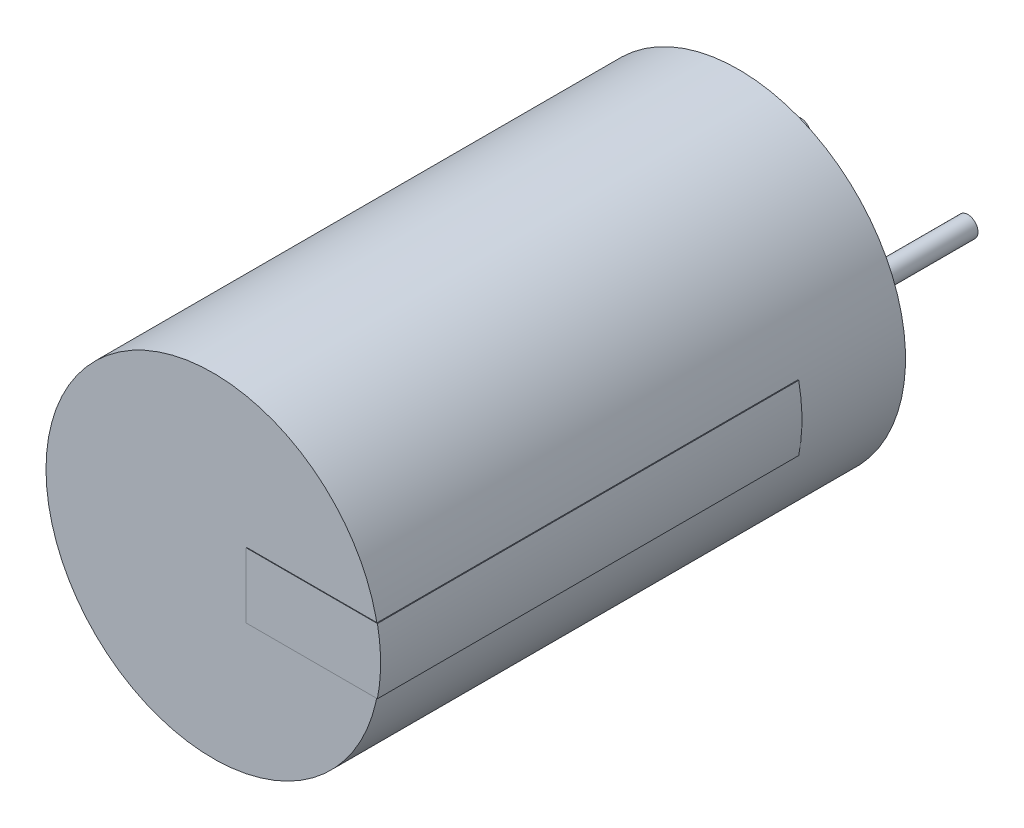
ISO-10303-21;
HEADER;
FILE_DESCRIPTION(('STEP AP214'),'2;1');
FILE_NAME('part.step','',(''),(''),'','','');
FILE_SCHEMA(('AUTOMOTIVE_DESIGN { 1 0 10303 214 1 1 1 1 }'));
ENDSEC;
DATA;
#1=APPLICATION_CONTEXT('core data for automotive mechanical design processes');
#2=APPLICATION_PROTOCOL_DEFINITION('international standard','automotive_design',2000,#1);
#3=PRODUCT_CONTEXT('',#1,'mechanical');
#4=PRODUCT('Part','Part','',(#3));
#5=PRODUCT_RELATED_PRODUCT_CATEGORY('part','',(#4));
#6=PRODUCT_DEFINITION_FORMATION('','',#4);
#7=PRODUCT_DEFINITION_CONTEXT('part definition',#1,'design');
#8=PRODUCT_DEFINITION('design','',#6,#7);
#9=PRODUCT_DEFINITION_SHAPE('','',#8);
#10=(LENGTH_UNIT() NAMED_UNIT(*) SI_UNIT(.MILLI.,.METRE.));
#11=(NAMED_UNIT(*) PLANE_ANGLE_UNIT() SI_UNIT($,.RADIAN.));
#12=(NAMED_UNIT(*) SI_UNIT($,.STERADIAN.) SOLID_ANGLE_UNIT());
#13=UNCERTAINTY_MEASURE_WITH_UNIT(LENGTH_MEASURE(1.E-05),#10,'distance_accuracy_value','');
#14=(GEOMETRIC_REPRESENTATION_CONTEXT(3) GLOBAL_UNCERTAINTY_ASSIGNED_CONTEXT((#13)) GLOBAL_UNIT_ASSIGNED_CONTEXT((#10,
#11,#12)) REPRESENTATION_CONTEXT('',''));
#15=CARTESIAN_POINT('',(0.,0.,0.));
#16=DIRECTION('',(0.,0.,1.));
#17=DIRECTION('',(1.,0.,0.));
#18=AXIS2_PLACEMENT_3D('',#15,#16,#17);
#19=CARTESIAN_POINT('',(0.,0.,0.));
#20=DIRECTION('',(0.,0.,1.));
#21=DIRECTION('',(1.,0.,0.));
#22=AXIS2_PLACEMENT_3D('',#19,#20,#21);
#23=PLANE('',#22);
#24=CARTESIAN_POINT('',(0.,0.,0.));
#25=DIRECTION('',(0.,0.,1.));
#26=DIRECTION('',(1.,0.,0.));
#27=AXIS2_PLACEMENT_3D('',#24,#25,#26);
#28=CIRCLE('',#27,0.3048);
#29=CARTESIAN_POINT('',(-0.305,0.,0.));
#30=VERTEX_POINT('',#29);
#31=EDGE_CURVE('P0_E45',#30,#30,#28,.T.);
#32=ORIENTED_EDGE('',*,*,#31,.T.);
#33=EDGE_LOOP('',(#32));
#34=FACE_BOUND('',#33,.T.);
#35=ADVANCED_FACE('P0_F17',(#34),#23,.T.);
#36=CARTESIAN_POINT('',(0.,0.,-4.369));
#37=DIRECTION('',(0.,0.,1.));
#38=DIRECTION('',(1.,0.,0.));
#39=AXIS2_PLACEMENT_3D('',#36,#37,#38);
#40=PLANE('',#39);
#41=CARTESIAN_POINT('',(0.,0.,-4.369));
#42=DIRECTION('',(0.,0.,-1.));
#43=DIRECTION('',(1.,0.,0.));
#44=AXIS2_PLACEMENT_3D('',#41,#42,#43);
#45=CIRCLE('',#44,0.3048);
#46=CARTESIAN_POINT('',(-0.305,0.,-4.369));
#47=VERTEX_POINT('',#46);
#48=EDGE_CURVE('P0_E11',#47,#47,#45,.T.);
#49=ORIENTED_EDGE('',*,*,#48,.T.);
#50=EDGE_LOOP('',(#49));
#51=FACE_BOUND('',#50,.T.);
#52=ADVANCED_FACE('P0_F19',(#51),#40,.F.);
#53=CARTESIAN_POINT('',(0.,0.,-4.369));
#54=DIRECTION('',(0.,0.,1.));
#55=DIRECTION('',(1.,0.,0.));
#56=AXIS2_PLACEMENT_3D('',#53,#54,#55);
#57=CYLINDRICAL_SURFACE('',#56,0.3048);
#58=ORIENTED_EDGE('',*,*,#31,.F.);
#59=CARTESIAN_POINT('',(-0.3048,0.,-4.369));
#60=CARTESIAN_POINT('',(-0.3048,0.,0.));
#61=(BOUNDED_CURVE() B_SPLINE_CURVE(1,(#59,#60),.UNSPECIFIED.,.F.,
.F.) B_SPLINE_CURVE_WITH_KNOTS((2,2),(0.,4.369),
.UNSPECIFIED.) CURVE() GEOMETRIC_REPRESENTATION_ITEM() RATIONAL_B_SPLINE_CURVE((1.,1.)) REPRESENTATION_ITEM(''));
#62=EDGE_CURVE('P0_E28',#47,#30,#61,.T.);
#63=ORIENTED_EDGE('',*,*,#62,.F.);
#64=ORIENTED_EDGE('',*,*,#48,.F.);
#65=ORIENTED_EDGE('',*,*,#62,.T.);
#66=EDGE_LOOP('',(#58,#63,#64,#65));
#67=FACE_BOUND('',#66,.T.);
#68=ADVANCED_FACE('P0_F44',(#67),#57,.T.);
#69=CLOSED_SHELL('',(#35,#52,#68));
#70=MANIFOLD_SOLID_BREP('P0_B1',#69);
#71=CARTESIAN_POINT('',(2.502,0.,15.748));
#72=DIRECTION('',(0.,0.,1.));
#73=DIRECTION('',(1.,0.,0.));
#74=AXIS2_PLACEMENT_3D('',#71,#72,#73);
#75=PLANE('',#74);
#76=CARTESIAN_POINT('',(2.502,0.,15.748));
#77=DIRECTION('',(0.,0.,1.));
#78=DIRECTION('',(1.,0.,0.));
#79=AXIS2_PLACEMENT_3D('',#76,#77,#78);
#80=CIRCLE('',#79,5.0038);
#81=CARTESIAN_POINT('',(-2.502,0.,15.748));
#82=VERTEX_POINT('',#81);
#83=EDGE_CURVE('P1_E44',#82,#82,#80,.T.);
#84=ORIENTED_EDGE('',*,*,#83,.T.);
#85=EDGE_LOOP('',(#84));
#86=FACE_BOUND('',#85,.T.);
#87=ADVANCED_FACE('P1_F17',(#86),#75,.T.);
#88=CARTESIAN_POINT('',(2.502,0.,0.));
#89=DIRECTION('',(0.,0.,1.));
#90=DIRECTION('',(1.,0.,0.));
#91=AXIS2_PLACEMENT_3D('',#88,#89,#90);
#92=PLANE('',#91);
#93=CARTESIAN_POINT('',(2.502,0.,0.));
#94=DIRECTION('',(0.,0.,-1.));
#95=DIRECTION('',(1.,0.,0.));
#96=AXIS2_PLACEMENT_3D('',#93,#94,#95);
#97=CIRCLE('',#96,5.0038);
#98=CARTESIAN_POINT('',(-2.502,0.,0.));
#99=VERTEX_POINT('',#98);
#100=EDGE_CURVE('P1_E11',#99,#99,#97,.T.);
#101=ORIENTED_EDGE('',*,*,#100,.T.);
#102=EDGE_LOOP('',(#101));
#103=FACE_BOUND('',#102,.T.);
#104=ADVANCED_FACE('P1_F76',(#103),#92,.F.);
#105=CARTESIAN_POINT('',(2.502,0.,0.));
#106=DIRECTION('',(0.,0.,1.));
#107=DIRECTION('',(1.,0.,0.));
#108=AXIS2_PLACEMENT_3D('',#105,#106,#107);
#109=CYLINDRICAL_SURFACE('',#108,5.0038);
#110=ORIENTED_EDGE('',*,*,#83,.F.);
#111=CARTESIAN_POINT('',(-2.5018,0.,0.));
#112=CARTESIAN_POINT('',(-2.5018,0.,15.748));
#113=(BOUNDED_CURVE() B_SPLINE_CURVE(1,(#111,#112),.UNSPECIFIED.,.F.,
.F.) B_SPLINE_CURVE_WITH_KNOTS((2,2),(0.,15.748),
.UNSPECIFIED.) CURVE() GEOMETRIC_REPRESENTATION_ITEM() RATIONAL_B_SPLINE_CURVE((1.,1.)) REPRESENTATION_ITEM(''));
#114=EDGE_CURVE('P1_E26',#99,#82,#113,.T.);
#115=ORIENTED_EDGE('',*,*,#114,.F.);
#116=ORIENTED_EDGE('',*,*,#100,.F.);
#117=ORIENTED_EDGE('',*,*,#114,.T.);
#118=EDGE_LOOP('',(#110,#115,#116,#117));
#119=FACE_BOUND('',#118,.T.);
#120=ADVANCED_FACE('P1_F43',(#119),#109,.T.);
#121=CLOSED_SHELL('',(#87,#104,#120));
#122=MANIFOLD_SOLID_BREP('P1_B1',#121);
#123=CARTESIAN_POINT('',(3.513,0.976,15.764));
#124=DIRECTION('',(0.,0.,1.));
#125=DIRECTION('',(1.,0.,0.));
#126=AXIS2_PLACEMENT_3D('',#123,#124,#125);
#127=PLANE('',#126);
#128=DIRECTION('',(-1.,0.,0.));
#129=VECTOR('',#128,1.);
#130=CARTESIAN_POINT('',(7.445,0.976,15.764));
#131=LINE('',#130,#129);
#132=CARTESIAN_POINT('',(7.445,0.976,15.764));
#133=VERTEX_POINT('',#132);
#134=CARTESIAN_POINT('',(3.513,0.976,15.764));
#135=VERTEX_POINT('',#134);
#136=EDGE_CURVE('P2_E193',#133,#135,#131,.T.);
#137=ORIENTED_EDGE('',*,*,#136,.T.);
#138=DIRECTION('',(0.,-1.,0.));
#139=VECTOR('',#138,1.);
#140=CARTESIAN_POINT('',(3.513,0.976,15.764));
#141=LINE('',#140,#139);
#142=CARTESIAN_POINT('',(3.513,-0.976,15.764));
#143=VERTEX_POINT('',#142);
#144=EDGE_CURVE('P2_E229',#135,#143,#141,.T.);
#145=ORIENTED_EDGE('',*,*,#144,.T.);
#146=DIRECTION('',(1.,0.,0.));
#147=VECTOR('',#146,1.);
#148=CARTESIAN_POINT('',(3.513,-0.976,15.764));
#149=LINE('',#148,#147);
#150=CARTESIAN_POINT('',(7.445,-0.976,15.764));
#151=VERTEX_POINT('',#150);
#152=EDGE_CURVE('P2_E222',#143,#151,#149,.T.);
#153=ORIENTED_EDGE('',*,*,#152,.T.);
#154=CARTESIAN_POINT('',(2.512,0.,15.764));
#155=DIRECTION('',(0.,0.,1.));
#156=DIRECTION('',(-1.,0.,0.));
#157=AXIS2_PLACEMENT_3D('',#154,#155,#156);
#158=CIRCLE('',#157,5.0292);
#159=EDGE_CURVE('P2_E63',#151,#133,#158,.T.);
#160=ORIENTED_EDGE('',*,*,#159,.T.);
#161=EDGE_LOOP('',(#137,#145,#153,#160));
#162=FACE_BOUND('',#161,.T.);
#163=ADVANCED_FACE('P2_F16',(#162),#127,.T.);
#164=CARTESIAN_POINT('',(3.513,-0.976,15.738));
#165=DIRECTION('',(0.,0.,-1.));
#166=DIRECTION('',(0.,-1.,0.));
#167=AXIS2_PLACEMENT_3D('',#164,#165,#166);
#168=PLANE('',#167);
#169=DIRECTION('',(-1.,0.,0.));
#170=VECTOR('',#169,1.);
#171=CARTESIAN_POINT('',(7.42,-0.976,15.738));
#172=LINE('',#171,#170);
#173=CARTESIAN_POINT('',(7.42,-0.976,15.738));
#174=VERTEX_POINT('',#173);
#175=CARTESIAN_POINT('',(3.513,-0.976,15.738));
#176=VERTEX_POINT('',#175);
#177=EDGE_CURVE('P2_E244',#174,#176,#172,.T.);
#178=ORIENTED_EDGE('',*,*,#177,.T.);
#179=DIRECTION('',(0.,1.,0.));
#180=VECTOR('',#179,1.);
#181=CARTESIAN_POINT('',(3.513,-0.976,15.738));
#182=LINE('',#181,#180);
#183=CARTESIAN_POINT('',(3.513,0.976,15.738));
#184=VERTEX_POINT('',#183);
#185=EDGE_CURVE('P2_E87',#176,#184,#182,.T.);
#186=ORIENTED_EDGE('',*,*,#185,.T.);
#187=DIRECTION('',(1.,0.,0.));
#188=VECTOR('',#187,1.);
#189=CARTESIAN_POINT('',(3.513,0.976,15.738));
#190=LINE('',#189,#188);
#191=CARTESIAN_POINT('',(7.42,0.976,15.738));
#192=VERTEX_POINT('',#191);
#193=EDGE_CURVE('P2_E103',#184,#192,#190,.T.);
#194=ORIENTED_EDGE('',*,*,#193,.T.);
#195=CARTESIAN_POINT('',(2.512,0.,15.738));
#196=DIRECTION('',(0.,0.,-1.));
#197=DIRECTION('',(1.,0.,0.));
#198=AXIS2_PLACEMENT_3D('',#195,#196,#197);
#199=CIRCLE('',#198,5.0038);
#200=EDGE_CURVE('P2_E10',#192,#174,#199,.T.);
#201=ORIENTED_EDGE('',*,*,#200,.T.);
#202=EDGE_LOOP('',(#178,#186,#194,#201));
#203=FACE_BOUND('',#202,.T.);
#204=ADVANCED_FACE('P2_F104',(#203),#168,.T.);
#205=CARTESIAN_POINT('',(7.445,0.976,3.14));
#206=DIRECTION('',(0.,0.,-1.));
#207=DIRECTION('',(0.,-1.,0.));
#208=AXIS2_PLACEMENT_3D('',#205,#206,#207);
#209=PLANE('',#208);
#210=DIRECTION('',(1.,0.,0.));
#211=VECTOR('',#210,1.);
#212=CARTESIAN_POINT('',(7.42,0.976,3.14));
#213=LINE('',#212,#211);
#214=CARTESIAN_POINT('',(7.42,0.976,3.14));
#215=VERTEX_POINT('',#214);
#216=CARTESIAN_POINT('',(7.445,0.976,3.14));
#217=VERTEX_POINT('',#216);
#218=EDGE_CURVE('P2_E113',#215,#217,#213,.T.);
#219=ORIENTED_EDGE('',*,*,#218,.T.);
#220=CARTESIAN_POINT('',(2.512,0.,3.14));
#221=DIRECTION('',(0.,0.,-1.));
#222=DIRECTION('',(1.,0.,0.));
#223=AXIS2_PLACEMENT_3D('',#220,#221,#222);
#224=CIRCLE('',#223,5.0292);
#225=CARTESIAN_POINT('',(7.445,-0.976,3.14));
#226=VERTEX_POINT('',#225);
#227=EDGE_CURVE('P2_E197',#217,#226,#224,.T.);
#228=ORIENTED_EDGE('',*,*,#227,.T.);
#229=DIRECTION('',(-1.,0.,0.));
#230=VECTOR('',#229,1.);
#231=CARTESIAN_POINT('',(7.445,-0.976,3.14));
#232=LINE('',#231,#230);
#233=CARTESIAN_POINT('',(7.42,-0.976,3.14));
#234=VERTEX_POINT('',#233);
#235=EDGE_CURVE('P2_E195',#226,#234,#232,.T.);
#236=ORIENTED_EDGE('',*,*,#235,.T.);
#237=CARTESIAN_POINT('',(2.512,0.,3.14));
#238=DIRECTION('',(0.,0.,1.));
#239=DIRECTION('',(-1.,0.,0.));
#240=AXIS2_PLACEMENT_3D('',#237,#238,#239);
#241=CIRCLE('',#240,5.0038);
#242=EDGE_CURVE('P2_E29',#234,#215,#241,.T.);
#243=ORIENTED_EDGE('',*,*,#242,.T.);
#244=EDGE_LOOP('',(#219,#228,#236,#243));
#245=FACE_BOUND('',#244,.T.);
#246=ADVANCED_FACE('P2_F18',(#245),#209,.T.);
#247=CARTESIAN_POINT('',(2.512,0.,3.14));
#248=DIRECTION('',(0.,0.,1.));
#249=DIRECTION('',(-1.,0.,0.));
#250=AXIS2_PLACEMENT_3D('',#247,#248,#249);
#251=CYLINDRICAL_SURFACE('',#250,5.0038);
#252=CARTESIAN_POINT('',(7.41970348881177,0.975941036079917,15.738));
#253=DIRECTION('',(0.,0.,-1.));
#254=VECTOR('',#253,1.);
#255=LINE('',#252,#254);
#256=EDGE_CURVE('P2_E96',#192,#215,#255,.T.);
#257=ORIENTED_EDGE('',*,*,#256,.T.);
#258=ORIENTED_EDGE('',*,*,#242,.F.);
#259=CARTESIAN_POINT('',(7.41970348881177,-0.975941036079924,3.14));
#260=DIRECTION('',(0.,0.,1.));
#261=VECTOR('',#260,1.);
#262=LINE('',#259,#261);
#263=EDGE_CURVE('P2_E99',#234,#174,#262,.T.);
#264=ORIENTED_EDGE('',*,*,#263,.T.);
#265=ORIENTED_EDGE('',*,*,#200,.F.);
#266=EDGE_LOOP('',(#257,#258,#264,#265));
#267=FACE_BOUND('',#266,.T.);
#268=ADVANCED_FACE('P2_F94',(#267),#251,.F.);
#269=CARTESIAN_POINT('',(2.512,0.,3.14));
#270=DIRECTION('',(0.,0.,1.));
#271=DIRECTION('',(-1.,0.,0.));
#272=AXIS2_PLACEMENT_3D('',#269,#270,#271);
#273=CYLINDRICAL_SURFACE('',#272,5.0292);
#274=CARTESIAN_POINT('',(7.44556449403419,-0.976111685825527,15.764));
#275=DIRECTION('',(0.,0.,-1.));
#276=VECTOR('',#275,1.);
#277=LINE('',#274,#276);
#278=EDGE_CURVE('P2_E211',#151,#226,#277,.T.);
#279=ORIENTED_EDGE('',*,*,#278,.T.);
#280=ORIENTED_EDGE('',*,*,#227,.F.);
#281=CARTESIAN_POINT('',(7.44556449403419,0.976111685825545,3.14));
#282=DIRECTION('',(0.,0.,1.));
#283=VECTOR('',#282,1.);
#284=LINE('',#281,#283);
#285=EDGE_CURVE('P2_E175',#217,#133,#284,.T.);
#286=ORIENTED_EDGE('',*,*,#285,.T.);
#287=ORIENTED_EDGE('',*,*,#159,.F.);
#288=EDGE_LOOP('',(#279,#280,#286,#287));
#289=FACE_BOUND('',#288,.T.);
#290=ADVANCED_FACE('P2_F129',(#289),#273,.T.);
#291=CARTESIAN_POINT('',(3.513,0.976,15.738));
#292=DIRECTION('',(-1.,0.,0.));
#293=DIRECTION('',(0.,0.,1.));
#294=AXIS2_PLACEMENT_3D('',#291,#292,#293);
#295=PLANE('',#294);
#296=ORIENTED_EDGE('',*,*,#185,.F.);
#297=DIRECTION('',(0.,0.,1.));
#298=VECTOR('',#297,1.);
#299=CARTESIAN_POINT('',(3.513,-0.976,15.738));
#300=LINE('',#299,#298);
#301=EDGE_CURVE('P2_E225',#176,#143,#300,.T.);
#302=ORIENTED_EDGE('',*,*,#301,.T.);
#303=ORIENTED_EDGE('',*,*,#144,.F.);
#304=DIRECTION('',(0.,0.,-1.));
#305=VECTOR('',#304,1.);
#306=CARTESIAN_POINT('',(3.513,0.976,15.764));
#307=LINE('',#306,#305);
#308=EDGE_CURVE('P2_E108',#135,#184,#307,.T.);
#309=ORIENTED_EDGE('',*,*,#308,.T.);
#310=EDGE_LOOP('',(#296,#302,#303,#309));
#311=FACE_BOUND('',#310,.T.);
#312=ADVANCED_FACE('P2_F160',(#311),#295,.T.);
#313=CARTESIAN_POINT('',(7.42,-0.976,3.14));
#314=DIRECTION('',(0.,-1.,0.));
#315=DIRECTION('',(0.,0.,-1.));
#316=AXIS2_PLACEMENT_3D('',#313,#314,#315);
#317=PLANE('',#316);
#318=ORIENTED_EDGE('',*,*,#235,.F.);
#319=ORIENTED_EDGE('',*,*,#278,.F.);
#320=ORIENTED_EDGE('',*,*,#152,.F.);
#321=ORIENTED_EDGE('',*,*,#301,.F.);
#322=ORIENTED_EDGE('',*,*,#177,.F.);
#323=ORIENTED_EDGE('',*,*,#263,.F.);
#324=EDGE_LOOP('',(#318,#319,#320,#321,#322,#323));
#325=FACE_BOUND('',#324,.T.);
#326=ADVANCED_FACE('P2_F152',(#325),#317,.T.);
#327=CARTESIAN_POINT('',(7.445,0.976,3.14));
#328=DIRECTION('',(0.,1.,0.));
#329=DIRECTION('',(1.,0.,0.));
#330=AXIS2_PLACEMENT_3D('',#327,#328,#329);
#331=PLANE('',#330);
#332=ORIENTED_EDGE('',*,*,#218,.F.);
#333=ORIENTED_EDGE('',*,*,#256,.F.);
#334=ORIENTED_EDGE('',*,*,#193,.F.);
#335=ORIENTED_EDGE('',*,*,#308,.F.);
#336=ORIENTED_EDGE('',*,*,#136,.F.);
#337=ORIENTED_EDGE('',*,*,#285,.F.);
#338=EDGE_LOOP('',(#332,#333,#334,#335,#336,#337));
#339=FACE_BOUND('',#338,.T.);
#340=ADVANCED_FACE('P2_F110',(#339),#331,.T.);
#341=CLOSED_SHELL('',(#163,#204,#246,#268,#290,#312,#326,#340));
#342=MANIFOLD_SOLID_BREP('P2_B1',#341);
#343=CARTESIAN_POINT('',(5.004,0.,0.));
#344=DIRECTION('',(0.,0.,1.));
#345=DIRECTION('',(1.,0.,0.));
#346=AXIS2_PLACEMENT_3D('',#343,#344,#345);
#347=PLANE('',#346);
#348=CARTESIAN_POINT('',(5.004,0.,0.));
#349=DIRECTION('',(0.,0.,1.));
#350=DIRECTION('',(1.,0.,0.));
#351=AXIS2_PLACEMENT_3D('',#348,#349,#350);
#352=CIRCLE('',#351,0.3048);
#353=CARTESIAN_POINT('',(4.699,0.,0.));
#354=VERTEX_POINT('',#353);
#355=EDGE_CURVE('P3_E44',#354,#354,#352,.T.);
#356=ORIENTED_EDGE('',*,*,#355,.T.);
#357=EDGE_LOOP('',(#356));
#358=FACE_BOUND('',#357,.T.);
#359=ADVANCED_FACE('P3_F17',(#358),#347,.T.);
#360=CARTESIAN_POINT('',(5.004,0.,-4.369));
#361=DIRECTION('',(0.,0.,1.));
#362=DIRECTION('',(1.,0.,0.));
#363=AXIS2_PLACEMENT_3D('',#360,#361,#362);
#364=PLANE('',#363);
#365=CARTESIAN_POINT('',(5.004,0.,-4.369));
#366=DIRECTION('',(0.,0.,-1.));
#367=DIRECTION('',(1.,0.,0.));
#368=AXIS2_PLACEMENT_3D('',#365,#366,#367);
#369=CIRCLE('',#368,0.3048);
#370=CARTESIAN_POINT('',(4.699,0.,-4.369));
#371=VERTEX_POINT('',#370);
#372=EDGE_CURVE('P3_E11',#371,#371,#369,.T.);
#373=ORIENTED_EDGE('',*,*,#372,.T.);
#374=EDGE_LOOP('',(#373));
#375=FACE_BOUND('',#374,.T.);
#376=ADVANCED_FACE('P3_F75',(#375),#364,.F.);
#377=CARTESIAN_POINT('',(5.004,0.,-4.369));
#378=DIRECTION('',(0.,0.,1.));
#379=DIRECTION('',(1.,0.,0.));
#380=AXIS2_PLACEMENT_3D('',#377,#378,#379);
#381=CYLINDRICAL_SURFACE('',#380,0.3048);
#382=ORIENTED_EDGE('',*,*,#355,.F.);
#383=CARTESIAN_POINT('',(4.6992,0.,-4.369));
#384=CARTESIAN_POINT('',(4.6992,0.,0.));
#385=(BOUNDED_CURVE() B_SPLINE_CURVE(1,(#383,#384),.UNSPECIFIED.,.F.,
.F.) B_SPLINE_CURVE_WITH_KNOTS((2,2),(0.,4.369),
.UNSPECIFIED.) CURVE() GEOMETRIC_REPRESENTATION_ITEM() RATIONAL_B_SPLINE_CURVE((1.,1.)) REPRESENTATION_ITEM(''));
#386=EDGE_CURVE('P3_E28',#371,#354,#385,.T.);
#387=ORIENTED_EDGE('',*,*,#386,.F.);
#388=ORIENTED_EDGE('',*,*,#372,.F.);
#389=ORIENTED_EDGE('',*,*,#386,.T.);
#390=EDGE_LOOP('',(#382,#387,#388,#389));
#391=FACE_BOUND('',#390,.T.);
#392=ADVANCED_FACE('P3_F19',(#391),#381,.T.);
#393=CLOSED_SHELL('',(#359,#376,#392));
#394=MANIFOLD_SOLID_BREP('P3_B1',#393);
#395=ADVANCED_BREP_SHAPE_REPRESENTATION('',(#18,#70,#122,#342,#394),#14);
#396=SHAPE_DEFINITION_REPRESENTATION(#9,#395);
ENDSEC;
END-ISO-10303-21;
